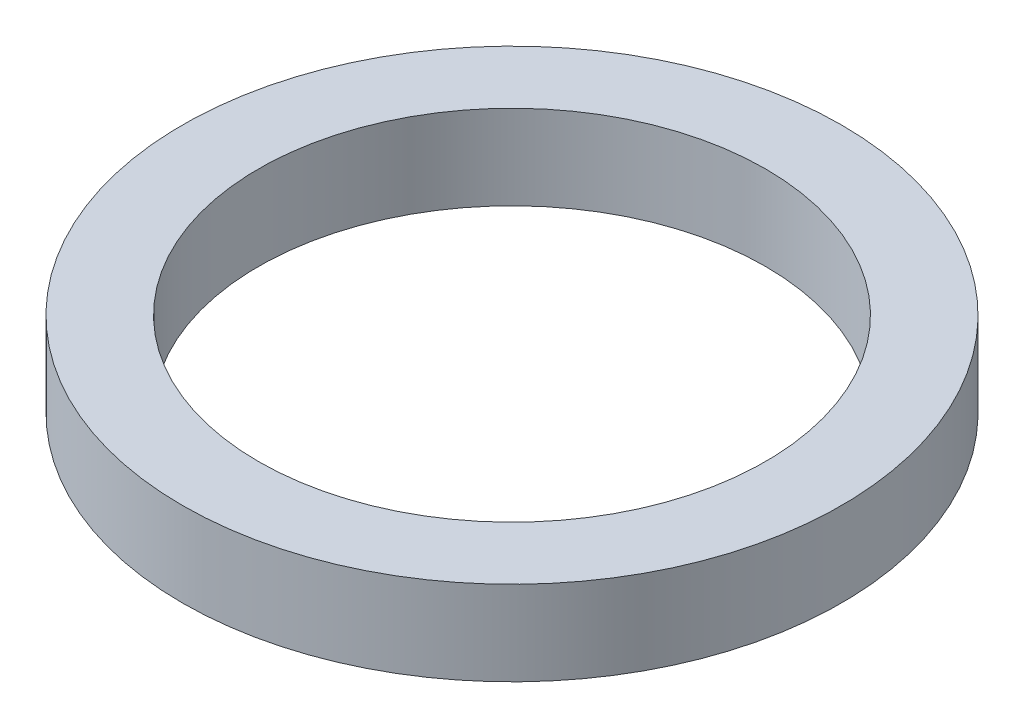
ISO-10303-21;
HEADER;
FILE_DESCRIPTION(('STEP AP214'),'2;1');
FILE_NAME('part.step','',(''),(''),'','','');
FILE_SCHEMA(('AUTOMOTIVE_DESIGN { 1 0 10303 214 1 1 1 1 }'));
ENDSEC;
DATA;
#1=APPLICATION_CONTEXT('core data for automotive mechanical design processes');
#2=APPLICATION_PROTOCOL_DEFINITION('international standard','automotive_design',2000,#1);
#3=PRODUCT_CONTEXT('',#1,'mechanical');
#4=PRODUCT('Part','Part','',(#3));
#5=PRODUCT_RELATED_PRODUCT_CATEGORY('part','',(#4));
#6=PRODUCT_DEFINITION_FORMATION('','',#4);
#7=PRODUCT_DEFINITION_CONTEXT('part definition',#1,'design');
#8=PRODUCT_DEFINITION('design','',#6,#7);
#9=PRODUCT_DEFINITION_SHAPE('','',#8);
#10=(LENGTH_UNIT() NAMED_UNIT(*) SI_UNIT(.MILLI.,.METRE.));
#11=(NAMED_UNIT(*) PLANE_ANGLE_UNIT() SI_UNIT($,.RADIAN.));
#12=(NAMED_UNIT(*) SI_UNIT($,.STERADIAN.) SOLID_ANGLE_UNIT());
#13=UNCERTAINTY_MEASURE_WITH_UNIT(LENGTH_MEASURE(1.E-05),#10,'distance_accuracy_value','');
#14=(GEOMETRIC_REPRESENTATION_CONTEXT(3) GLOBAL_UNCERTAINTY_ASSIGNED_CONTEXT((#13)) GLOBAL_UNIT_ASSIGNED_CONTEXT((#10,
#11,#12)) REPRESENTATION_CONTEXT('',''));
#15=CARTESIAN_POINT('',(0.,0.,0.));
#16=DIRECTION('',(0.,0.,1.));
#17=DIRECTION('',(1.,0.,0.));
#18=AXIS2_PLACEMENT_3D('',#15,#16,#17);
#19=CARTESIAN_POINT('',(0.,10.,0.));
#20=DIRECTION('',(0.,1.,0.));
#21=DIRECTION('',(0.,0.,1.));
#22=AXIS2_PLACEMENT_3D('',#19,#20,#21);
#23=PLANE('',#22);
#24=CARTESIAN_POINT('',(0.,10.,0.));
#25=DIRECTION('',(0.,1.,0.));
#26=DIRECTION('',(0.,0.,1.));
#27=AXIS2_PLACEMENT_3D('',#24,#25,#26);
#28=CIRCLE('',#27,39.);
#29=CARTESIAN_POINT('',(0.,10.,39.));
#30=VERTEX_POINT('',#29);
#31=EDGE_CURVE('E10',#30,#30,#28,.T.);
#32=ORIENTED_EDGE('',*,*,#31,.T.);
#33=EDGE_LOOP('',(#32));
#34=FACE_BOUND('',#33,.T.);
#35=CARTESIAN_POINT('',(0.,10.,0.));
#36=DIRECTION('',(0.,1.,0.));
#37=DIRECTION('',(0.,0.,1.));
#38=AXIS2_PLACEMENT_3D('',#35,#36,#37);
#39=CIRCLE('',#38,30.);
#40=CARTESIAN_POINT('',(0.,10.,30.));
#41=VERTEX_POINT('',#40);
#42=EDGE_CURVE('E50',#41,#41,#39,.T.);
#43=ORIENTED_EDGE('',*,*,#42,.F.);
#44=EDGE_LOOP('',(#43));
#45=FACE_BOUND('',#44,.T.);
#46=ADVANCED_FACE('F37',(#34,#45),#23,.T.);
#47=CARTESIAN_POINT('',(0.,0.,0.));
#48=DIRECTION('',(0.,1.,0.));
#49=DIRECTION('',(0.,0.,1.));
#50=AXIS2_PLACEMENT_3D('',#47,#48,#49);
#51=PLANE('',#50);
#52=CARTESIAN_POINT('',(0.,0.,0.));
#53=DIRECTION('',(0.,1.,0.));
#54=DIRECTION('',(0.,0.,1.));
#55=AXIS2_PLACEMENT_3D('',#52,#53,#54);
#56=CIRCLE('',#55,39.);
#57=CARTESIAN_POINT('',(0.,0.,39.));
#58=VERTEX_POINT('',#57);
#59=EDGE_CURVE('E41',#58,#58,#56,.T.);
#60=ORIENTED_EDGE('',*,*,#59,.F.);
#61=EDGE_LOOP('',(#60));
#62=FACE_BOUND('',#61,.T.);
#63=CARTESIAN_POINT('',(0.,0.,0.));
#64=DIRECTION('',(0.,1.,0.));
#65=DIRECTION('',(0.,0.,1.));
#66=AXIS2_PLACEMENT_3D('',#63,#64,#65);
#67=CIRCLE('',#66,30.);
#68=CARTESIAN_POINT('',(0.,0.,30.));
#69=VERTEX_POINT('',#68);
#70=EDGE_CURVE('E52',#69,#69,#67,.T.);
#71=ORIENTED_EDGE('',*,*,#70,.T.);
#72=EDGE_LOOP('',(#71));
#73=FACE_BOUND('',#72,.T.);
#74=ADVANCED_FACE('F64',(#62,#73),#51,.F.);
#75=CARTESIAN_POINT('',(0.,10.,0.));
#76=DIRECTION('',(0.,-1.,0.));
#77=DIRECTION('',(0.,0.,-1.));
#78=AXIS2_PLACEMENT_3D('',#75,#76,#77);
#79=CYLINDRICAL_SURFACE('',#78,39.);
#80=ORIENTED_EDGE('',*,*,#31,.F.);
#81=EDGE_LOOP('',(#80));
#82=FACE_BOUND('',#81,.T.);
#83=ORIENTED_EDGE('',*,*,#59,.T.);
#84=EDGE_LOOP('',(#83));
#85=FACE_BOUND('',#84,.T.);
#86=ADVANCED_FACE('F39',(#82,#85),#79,.T.);
#87=CARTESIAN_POINT('',(0.,10.,0.));
#88=DIRECTION('',(0.,-1.,0.));
#89=DIRECTION('',(0.,0.,-1.));
#90=AXIS2_PLACEMENT_3D('',#87,#88,#89);
#91=CYLINDRICAL_SURFACE('',#90,30.);
#92=ORIENTED_EDGE('',*,*,#42,.T.);
#93=EDGE_LOOP('',(#92));
#94=FACE_BOUND('',#93,.T.);
#95=ORIENTED_EDGE('',*,*,#70,.F.);
#96=EDGE_LOOP('',(#95));
#97=FACE_BOUND('',#96,.T.);
#98=ADVANCED_FACE('F60',(#94,#97),#91,.F.);
#99=CLOSED_SHELL('',(#46,#74,#86,#98));
#100=MANIFOLD_SOLID_BREP('B2',#99);
#101=ADVANCED_BREP_SHAPE_REPRESENTATION('',(#18,#100),#14);
#102=SHAPE_DEFINITION_REPRESENTATION(#9,#101);
ENDSEC;
END-ISO-10303-21;
